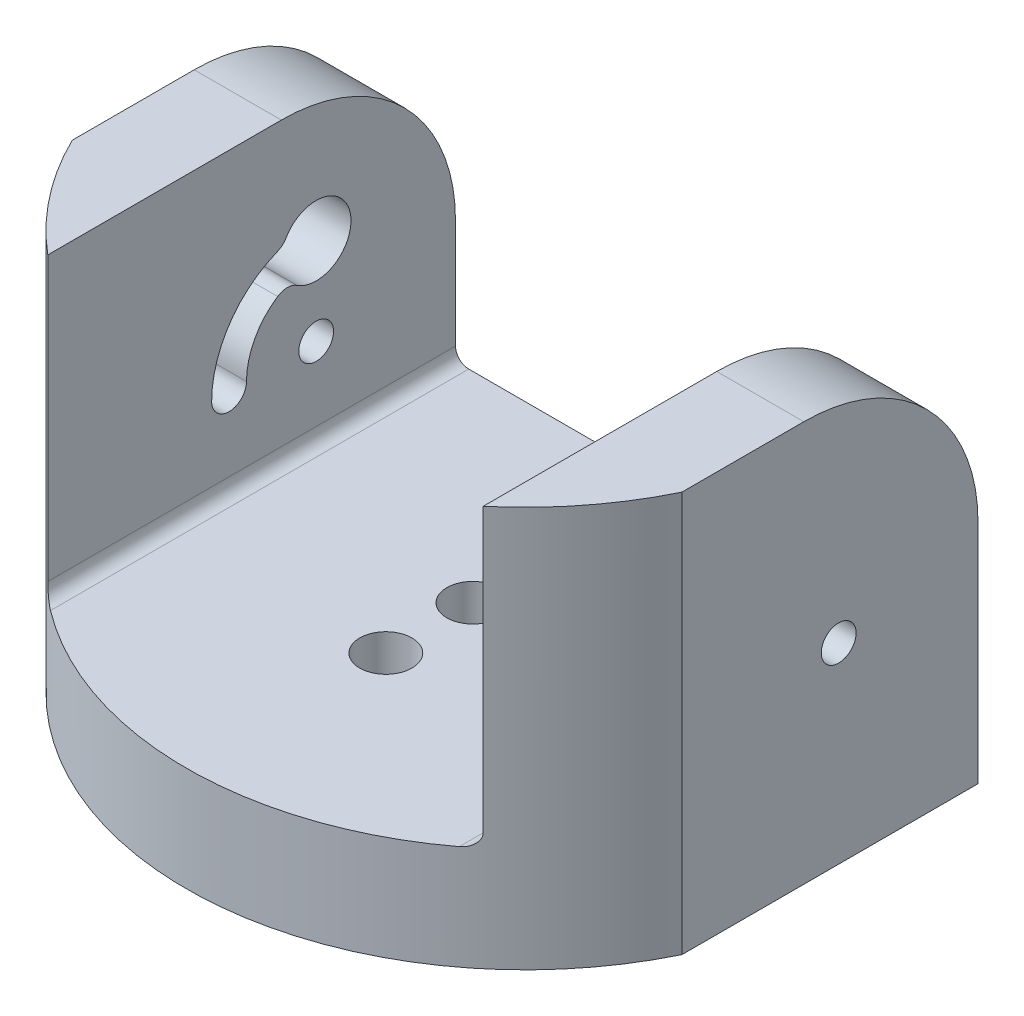
ISO-10303-21;
HEADER;
FILE_DESCRIPTION(('STEP AP214'),'2;1');
FILE_NAME('part.step','',(''),(''),'','','');
FILE_SCHEMA(('AUTOMOTIVE_DESIGN { 1 0 10303 214 1 1 1 1 }'));
ENDSEC;
DATA;
#1=APPLICATION_CONTEXT('core data for automotive mechanical design processes');
#2=APPLICATION_PROTOCOL_DEFINITION('international standard','automotive_design',2000,#1);
#3=PRODUCT_CONTEXT('',#1,'mechanical');
#4=PRODUCT('Part','Part','',(#3));
#5=PRODUCT_RELATED_PRODUCT_CATEGORY('part','',(#4));
#6=PRODUCT_DEFINITION_FORMATION('','',#4);
#7=PRODUCT_DEFINITION_CONTEXT('part definition',#1,'design');
#8=PRODUCT_DEFINITION('design','',#6,#7);
#9=PRODUCT_DEFINITION_SHAPE('','',#8);
#10=(LENGTH_UNIT() NAMED_UNIT(*) SI_UNIT(.MILLI.,.METRE.));
#11=(NAMED_UNIT(*) PLANE_ANGLE_UNIT() SI_UNIT($,.RADIAN.));
#12=(NAMED_UNIT(*) SI_UNIT($,.STERADIAN.) SOLID_ANGLE_UNIT());
#13=UNCERTAINTY_MEASURE_WITH_UNIT(LENGTH_MEASURE(1.E-05),#10,'distance_accuracy_value','');
#14=(GEOMETRIC_REPRESENTATION_CONTEXT(3) GLOBAL_UNCERTAINTY_ASSIGNED_CONTEXT((#13)) GLOBAL_UNIT_ASSIGNED_CONTEXT((#10,
#11,#12)) REPRESENTATION_CONTEXT('',''));
#15=CARTESIAN_POINT('',(0.,0.,0.));
#16=DIRECTION('',(0.,0.,1.));
#17=DIRECTION('',(1.,0.,0.));
#18=AXIS2_PLACEMENT_3D('',#15,#16,#17);
#19=CARTESIAN_POINT('',(0.,6.,0.));
#20=DIRECTION('',(0.,-1.,0.));
#21=DIRECTION('',(0.,0.,-1.));
#22=AXIS2_PLACEMENT_3D('',#19,#20,#21);
#23=PLANE('',#22);
#24=CARTESIAN_POINT('',(0.,6.,-11.));
#25=DIRECTION('',(0.,1.,0.));
#26=DIRECTION('',(0.,0.,1.));
#27=AXIS2_PLACEMENT_3D('',#24,#25,#26);
#28=CIRCLE('',#27,1.5);
#29=CARTESIAN_POINT('',(0.,6.,-9.5));
#30=VERTEX_POINT('',#29);
#31=EDGE_CURVE('E724',#30,#30,#28,.T.);
#32=ORIENTED_EDGE('',*,*,#31,.F.);
#33=EDGE_LOOP('',(#32));
#34=FACE_BOUND('',#33,.T.);
#35=CARTESIAN_POINT('',(0.,6.,-6.));
#36=DIRECTION('',(0.,1.,0.));
#37=DIRECTION('',(0.,0.,1.));
#38=AXIS2_PLACEMENT_3D('',#35,#36,#37);
#39=CIRCLE('',#38,1.5);
#40=CARTESIAN_POINT('',(0.,6.,-4.5));
#41=VERTEX_POINT('',#40);
#42=EDGE_CURVE('E734',#41,#41,#39,.T.);
#43=ORIENTED_EDGE('',*,*,#42,.F.);
#44=EDGE_LOOP('',(#43));
#45=FACE_BOUND('',#44,.T.);
#46=DIRECTION('',(0.,0.,1.));
#47=VECTOR('',#46,1.);
#48=CARTESIAN_POINT('',(-11.738,6.,0.));
#49=LINE('',#48,#47);
#50=CARTESIAN_POINT('',(-11.738,6.,-22.5));
#51=VERTEX_POINT('',#50);
#52=CARTESIAN_POINT('',(-11.738,6.,1.51513312865861));
#53=VERTEX_POINT('',#52);
#54=EDGE_CURVE('E227',#51,#53,#49,.T.);
#55=ORIENTED_EDGE('',*,*,#54,.T.);
#56=CARTESIAN_POINT('',(0.,6.,-14.));
#57=DIRECTION('',(0.,-1.,0.));
#58=DIRECTION('',(0.,0.,-1.));
#59=AXIS2_PLACEMENT_3D('',#56,#57,#58);
#60=CIRCLE('',#59,19.4550764583437);
#61=CARTESIAN_POINT('',(11.738,6.,1.51513312865861));
#62=VERTEX_POINT('',#61);
#63=EDGE_CURVE('E64',#53,#62,#60,.F.);
#64=ORIENTED_EDGE('',*,*,#63,.T.);
#65=DIRECTION('',(0.,0.,1.));
#66=VECTOR('',#65,1.);
#67=CARTESIAN_POINT('',(11.738,6.,0.));
#68=LINE('',#67,#66);
#69=CARTESIAN_POINT('',(11.738,6.,-22.5));
#70=VERTEX_POINT('',#69);
#71=EDGE_CURVE('E231',#62,#70,#68,.F.);
#72=ORIENTED_EDGE('',*,*,#71,.T.);
#73=DIRECTION('',(-1.,0.,0.));
#74=VECTOR('',#73,1.);
#75=CARTESIAN_POINT('',(-17.5,6.,-22.5));
#76=LINE('',#75,#74);
#77=EDGE_CURVE('E200',#70,#51,#76,.T.);
#78=ORIENTED_EDGE('',*,*,#77,.T.);
#79=EDGE_LOOP('',(#55,#64,#72,#78));
#80=FACE_BOUND('',#79,.T.);
#81=ADVANCED_FACE('F42',(#34,#45,#80),#23,.F.);
#82=CARTESIAN_POINT('',(0.,0.,0.));
#83=DIRECTION('',(0.,-1.,0.));
#84=DIRECTION('',(0.,0.,-1.));
#85=AXIS2_PLACEMENT_3D('',#82,#83,#84);
#86=PLANE('',#85);
#87=CARTESIAN_POINT('',(0.,0.,-11.));
#88=DIRECTION('',(0.,-1.,0.));
#89=DIRECTION('',(0.,0.,-1.));
#90=AXIS2_PLACEMENT_3D('',#87,#88,#89);
#91=CIRCLE('',#90,1.5);
#92=CARTESIAN_POINT('',(0.,0.,-12.5));
#93=VERTEX_POINT('',#92);
#94=EDGE_CURVE('E193',#93,#93,#91,.F.);
#95=ORIENTED_EDGE('',*,*,#94,.T.);
#96=EDGE_LOOP('',(#95));
#97=FACE_BOUND('',#96,.T.);
#98=CARTESIAN_POINT('',(0.,0.,-6.));
#99=DIRECTION('',(0.,-1.,0.));
#100=DIRECTION('',(0.,0.,-1.));
#101=AXIS2_PLACEMENT_3D('',#98,#99,#100);
#102=CIRCLE('',#101,1.5);
#103=CARTESIAN_POINT('',(0.,0.,-7.5));
#104=VERTEX_POINT('',#103);
#105=EDGE_CURVE('E731',#104,#104,#102,.F.);
#106=ORIENTED_EDGE('',*,*,#105,.T.);
#107=EDGE_LOOP('',(#106));
#108=FACE_BOUND('',#107,.T.);
#109=CARTESIAN_POINT('',(0.,0.,-14.));
#110=DIRECTION('',(0.,1.,0.));
#111=DIRECTION('',(0.,0.,-1.));
#112=AXIS2_PLACEMENT_3D('',#109,#110,#111);
#113=CIRCLE('',#112,19.4550764583437);
#114=CARTESIAN_POINT('',(-17.5,0.,-5.49999999999999));
#115=VERTEX_POINT('',#114);
#116=CARTESIAN_POINT('',(17.5,0.,-5.50000000000001));
#117=VERTEX_POINT('',#116);
#118=EDGE_CURVE('E175',#115,#117,#113,.T.);
#119=ORIENTED_EDGE('',*,*,#118,.F.);
#120=DIRECTION('',(0.,0.,1.));
#121=VECTOR('',#120,1.);
#122=CARTESIAN_POINT('',(-17.5,0.,22.5));
#123=LINE('',#122,#121);
#124=CARTESIAN_POINT('',(-17.5,0.,-22.5));
#125=VERTEX_POINT('',#124);
#126=EDGE_CURVE('E190',#125,#115,#123,.T.);
#127=ORIENTED_EDGE('',*,*,#126,.F.);
#128=DIRECTION('',(-1.,0.,0.));
#129=VECTOR('',#128,1.);
#130=CARTESIAN_POINT('',(-17.5,0.,-22.5));
#131=LINE('',#130,#129);
#132=CARTESIAN_POINT('',(17.5,0.,-22.5));
#133=VERTEX_POINT('',#132);
#134=EDGE_CURVE('E201',#133,#125,#131,.T.);
#135=ORIENTED_EDGE('',*,*,#134,.F.);
#136=DIRECTION('',(0.,0.,-1.));
#137=VECTOR('',#136,1.);
#138=CARTESIAN_POINT('',(17.5,0.,22.5));
#139=LINE('',#138,#137);
#140=EDGE_CURVE('E191',#117,#133,#139,.T.);
#141=ORIENTED_EDGE('',*,*,#140,.F.);
#142=EDGE_LOOP('',(#119,#127,#135,#141));
#143=FACE_BOUND('',#142,.T.);
#144=ADVANCED_FACE('F188',(#97,#108,#143),#86,.T.);
#145=CARTESIAN_POINT('',(-12.5,23.,-22.5));
#146=DIRECTION('',(0.,1.,0.));
#147=DIRECTION('',(0.,0.,1.));
#148=AXIS2_PLACEMENT_3D('',#145,#146,#147);
#149=PLANE('',#148);
#150=CARTESIAN_POINT('',(0.,23.,-14.));
#151=DIRECTION('',(0.,1.,0.));
#152=DIRECTION('',(0.,0.,1.));
#153=AXIS2_PLACEMENT_3D('',#150,#151,#152);
#154=CIRCLE('',#153,19.4550764583437);
#155=CARTESIAN_POINT('',(-17.5,23.,-5.49999999999999));
#156=VERTEX_POINT('',#155);
#157=CARTESIAN_POINT('',(-12.5,23.,0.90805151587557));
#158=VERTEX_POINT('',#157);
#159=EDGE_CURVE('E178',#156,#158,#154,.T.);
#160=ORIENTED_EDGE('',*,*,#159,.T.);
#161=DIRECTION('',(0.,0.,-1.));
#162=VECTOR('',#161,1.);
#163=CARTESIAN_POINT('',(-12.5,23.,-22.5));
#164=LINE('',#163,#162);
#165=CARTESIAN_POINT('',(-12.5,23.,-12.5));
#166=VERTEX_POINT('',#165);
#167=EDGE_CURVE('E349',#158,#166,#164,.T.);
#168=ORIENTED_EDGE('',*,*,#167,.T.);
#169=DIRECTION('',(-1.,0.,0.));
#170=VECTOR('',#169,1.);
#171=CARTESIAN_POINT('',(-17.5,23.,-12.5));
#172=LINE('',#171,#170);
#173=CARTESIAN_POINT('',(-17.5,23.,-12.5));
#174=VERTEX_POINT('',#173);
#175=EDGE_CURVE('E247',#166,#174,#172,.T.);
#176=ORIENTED_EDGE('',*,*,#175,.T.);
#177=DIRECTION('',(0.,0.,-1.));
#178=VECTOR('',#177,1.);
#179=CARTESIAN_POINT('',(-17.5,23.,-22.5));
#180=LINE('',#179,#178);
#181=EDGE_CURVE('E346',#156,#174,#180,.T.);
#182=ORIENTED_EDGE('',*,*,#181,.F.);
#183=EDGE_LOOP('',(#160,#168,#176,#182));
#184=FACE_BOUND('',#183,.T.);
#185=ADVANCED_FACE('F439',(#184),#149,.T.);
#186=CARTESIAN_POINT('',(12.5,23.,-22.5));
#187=DIRECTION('',(0.,-1.,0.));
#188=DIRECTION('',(0.,0.,-1.));
#189=AXIS2_PLACEMENT_3D('',#186,#187,#188);
#190=PLANE('',#189);
#191=DIRECTION('',(0.,0.,-1.));
#192=VECTOR('',#191,1.);
#193=CARTESIAN_POINT('',(12.5,23.,-22.5));
#194=LINE('',#193,#192);
#195=CARTESIAN_POINT('',(12.5,23.,0.90805151587557));
#196=VERTEX_POINT('',#195);
#197=CARTESIAN_POINT('',(12.5,23.,-12.5));
#198=VERTEX_POINT('',#197);
#199=EDGE_CURVE('E343',#196,#198,#194,.T.);
#200=ORIENTED_EDGE('',*,*,#199,.F.);
#201=CARTESIAN_POINT('',(17.5,23.,-5.50000000000001));
#202=VERTEX_POINT('',#201);
#203=EDGE_CURVE('E183',#196,#202,#154,.T.);
#204=ORIENTED_EDGE('',*,*,#203,.T.);
#205=DIRECTION('',(0.,0.,-1.));
#206=VECTOR('',#205,1.);
#207=CARTESIAN_POINT('',(17.5,23.,-22.5));
#208=LINE('',#207,#206);
#209=CARTESIAN_POINT('',(17.5,23.,-12.5));
#210=VERTEX_POINT('',#209);
#211=EDGE_CURVE('E339',#202,#210,#208,.T.);
#212=ORIENTED_EDGE('',*,*,#211,.T.);
#213=DIRECTION('',(1.,0.,0.));
#214=VECTOR('',#213,1.);
#215=CARTESIAN_POINT('',(12.5,23.,-12.5));
#216=LINE('',#215,#214);
#217=EDGE_CURVE('E255',#210,#198,#216,.F.);
#218=ORIENTED_EDGE('',*,*,#217,.T.);
#219=EDGE_LOOP('',(#200,#204,#212,#218));
#220=FACE_BOUND('',#219,.T.);
#221=ADVANCED_FACE('F375',(#220),#190,.F.);
#222=CARTESIAN_POINT('',(17.5,6.,22.5));
#223=DIRECTION('',(-1.,0.,0.));
#224=DIRECTION('',(0.,0.,1.));
#225=AXIS2_PLACEMENT_3D('',#222,#223,#224);
#226=PLANE('',#225);
#227=CARTESIAN_POINT('',(17.5,11.,-14.5));
#228=DIRECTION('',(-1.,0.,0.));
#229=DIRECTION('',(0.,0.,1.));
#230=AXIS2_PLACEMENT_3D('',#227,#228,#229);
#231=CIRCLE('',#230,1.);
#232=CARTESIAN_POINT('',(17.5,11.,-13.5));
#233=VERTEX_POINT('',#232);
#234=EDGE_CURVE('E223',#233,#233,#231,.T.);
#235=ORIENTED_EDGE('',*,*,#234,.T.);
#236=EDGE_LOOP('',(#235));
#237=FACE_BOUND('',#236,.T.);
#238=ORIENTED_EDGE('',*,*,#211,.F.);
#239=DIRECTION('',(0.,-1.,0.));
#240=VECTOR('',#239,1.);
#241=CARTESIAN_POINT('',(17.5,67.8218696620299,-5.50000000000001));
#242=LINE('',#241,#240);
#243=EDGE_CURVE('E363',#202,#117,#242,.T.);
#244=ORIENTED_EDGE('',*,*,#243,.T.);
#245=ORIENTED_EDGE('',*,*,#140,.T.);
#246=DIRECTION('',(0.,-1.,0.));
#247=VECTOR('',#246,1.);
#248=CARTESIAN_POINT('',(17.5,6.,-22.5));
#249=LINE('',#248,#247);
#250=CARTESIAN_POINT('',(17.5,13.,-22.5));
#251=VERTEX_POINT('',#250);
#252=EDGE_CURVE('E213',#251,#133,#249,.T.);
#253=ORIENTED_EDGE('',*,*,#252,.F.);
#254=CARTESIAN_POINT('',(17.5,13.,-12.5));
#255=DIRECTION('',(-1.,0.,0.));
#256=DIRECTION('',(0.,0.,1.));
#257=AXIS2_PLACEMENT_3D('',#254,#255,#256);
#258=CIRCLE('',#257,10.);
#259=EDGE_CURVE('E259',#251,#210,#258,.F.);
#260=ORIENTED_EDGE('',*,*,#259,.T.);
#261=EDGE_LOOP('',(#238,#244,#245,#253,#260));
#262=FACE_BOUND('',#261,.T.);
#263=ADVANCED_FACE('F362',(#237,#262),#226,.F.);
#264=CARTESIAN_POINT('',(-17.5,6.,-22.5));
#265=DIRECTION('',(0.,0.,1.));
#266=DIRECTION('',(1.,0.,0.));
#267=AXIS2_PLACEMENT_3D('',#264,#265,#266);
#268=PLANE('',#267);
#269=DIRECTION('',(0.,-1.,0.));
#270=VECTOR('',#269,1.);
#271=CARTESIAN_POINT('',(12.5,6.,-22.5));
#272=LINE('',#271,#270);
#273=CARTESIAN_POINT('',(12.5,13.,-22.5));
#274=VERTEX_POINT('',#273);
#275=CARTESIAN_POINT('',(12.5,6.762,-22.5));
#276=VERTEX_POINT('',#275);
#277=EDGE_CURVE('E340',#274,#276,#272,.T.);
#278=ORIENTED_EDGE('',*,*,#277,.F.);
#279=DIRECTION('',(1.,0.,0.));
#280=VECTOR('',#279,1.);
#281=CARTESIAN_POINT('',(-17.5,13.,-22.5));
#282=LINE('',#281,#280);
#283=EDGE_CURVE('E269',#274,#251,#282,.T.);
#284=ORIENTED_EDGE('',*,*,#283,.T.);
#285=ORIENTED_EDGE('',*,*,#252,.T.);
#286=ORIENTED_EDGE('',*,*,#134,.T.);
#287=DIRECTION('',(0.,-1.,0.));
#288=VECTOR('',#287,1.);
#289=CARTESIAN_POINT('',(-17.5,6.,-22.5));
#290=LINE('',#289,#288);
#291=CARTESIAN_POINT('',(-17.5,13.,-22.5));
#292=VERTEX_POINT('',#291);
#293=EDGE_CURVE('E197',#292,#125,#290,.T.);
#294=ORIENTED_EDGE('',*,*,#293,.F.);
#295=DIRECTION('',(-1.,0.,0.));
#296=VECTOR('',#295,1.);
#297=CARTESIAN_POINT('',(-12.5,13.,-22.5));
#298=LINE('',#297,#296);
#299=CARTESIAN_POINT('',(-12.5,13.,-22.5));
#300=VERTEX_POINT('',#299);
#301=EDGE_CURVE('E266',#292,#300,#298,.F.);
#302=ORIENTED_EDGE('',*,*,#301,.T.);
#303=DIRECTION('',(0.,-1.,0.));
#304=VECTOR('',#303,1.);
#305=CARTESIAN_POINT('',(-12.5,6.,-22.5));
#306=LINE('',#305,#304);
#307=CARTESIAN_POINT('',(-12.5,6.762,-22.5));
#308=VERTEX_POINT('',#307);
#309=EDGE_CURVE('E352',#300,#308,#306,.T.);
#310=ORIENTED_EDGE('',*,*,#309,.T.);
#311=CARTESIAN_POINT('',(-11.738,6.762,-22.5));
#312=DIRECTION('',(0.,0.,1.));
#313=DIRECTION('',(1.,0.,0.));
#314=AXIS2_PLACEMENT_3D('',#311,#312,#313);
#315=CIRCLE('',#314,0.762);
#316=EDGE_CURVE('E241',#308,#51,#315,.T.);
#317=ORIENTED_EDGE('',*,*,#316,.T.);
#318=ORIENTED_EDGE('',*,*,#77,.F.);
#319=CARTESIAN_POINT('',(11.738,6.762,-22.5));
#320=DIRECTION('',(0.,0.,1.));
#321=DIRECTION('',(1.,0.,0.));
#322=AXIS2_PLACEMENT_3D('',#319,#320,#321);
#323=CIRCLE('',#322,0.762);
#324=EDGE_CURVE('E237',#70,#276,#323,.T.);
#325=ORIENTED_EDGE('',*,*,#324,.T.);
#326=EDGE_LOOP('',(#278,#284,#285,#286,#294,#302,#310,#317,#318,#325));
#327=FACE_BOUND('',#326,.T.);
#328=ADVANCED_FACE('F366',(#327),#268,.F.);
#329=CARTESIAN_POINT('',(-17.5,6.,22.5));
#330=DIRECTION('',(1.,0.,0.));
#331=DIRECTION('',(0.,0.,-1.));
#332=AXIS2_PLACEMENT_3D('',#329,#330,#331);
#333=PLANE('',#332);
#334=CARTESIAN_POINT('',(-17.5,11.,-14.5));
#335=DIRECTION('',(1.,0.,0.));
#336=DIRECTION('',(0.,0.,-1.));
#337=AXIS2_PLACEMENT_3D('',#334,#335,#336);
#338=CIRCLE('',#337,1.);
#339=CARTESIAN_POINT('',(-17.5,11.,-15.5));
#340=VERTEX_POINT('',#339);
#341=EDGE_CURVE('E314',#340,#340,#338,.F.);
#342=ORIENTED_EDGE('',*,*,#341,.F.);
#343=EDGE_LOOP('',(#342));
#344=FACE_BOUND('',#343,.T.);
#345=CARTESIAN_POINT('',(-17.5,11.,-14.5));
#346=DIRECTION('',(1.,0.,0.));
#347=DIRECTION('',(0.,0.,-1.));
#348=AXIS2_PLACEMENT_3D('',#345,#346,#347);
#349=CIRCLE('',#348,4.);
#350=CARTESIAN_POINT('',(-17.5,14.3333333333333,-12.2889168064297));
#351=VERTEX_POINT('',#350);
#352=CARTESIAN_POINT('',(-17.5,11.,-10.5));
#353=VERTEX_POINT('',#352);
#354=EDGE_CURVE('E324',#351,#353,#349,.T.);
#355=ORIENTED_EDGE('',*,*,#354,.F.);
#356=CARTESIAN_POINT('',(-17.5,13.5,-12.8416876048223));
#357=DIRECTION('',(1.,0.,0.));
#358=DIRECTION('',(0.,0.,-1.));
#359=AXIS2_PLACEMENT_3D('',#356,#357,#358);
#360=CIRCLE('',#359,1.);
#361=CARTESIAN_POINT('',(-17.5,14.3333333333333,-13.3944584032149));
#362=VERTEX_POINT('',#361);
#363=EDGE_CURVE('E280',#351,#362,#360,.F.);
#364=ORIENTED_EDGE('',*,*,#363,.T.);
#365=CARTESIAN_POINT('',(-17.5,16.,-14.5));
#366=DIRECTION('',(-1.,0.,0.));
#367=DIRECTION('',(0.,0.,1.));
#368=AXIS2_PLACEMENT_3D('',#365,#366,#367);
#369=CIRCLE('',#368,2.);
#370=CARTESIAN_POINT('',(-17.5,17.,-12.7679491924311));
#371=VERTEX_POINT('',#370);
#372=EDGE_CURVE('E468',#371,#362,#369,.T.);
#373=ORIENTED_EDGE('',*,*,#372,.F.);
#374=CARTESIAN_POINT('',(-17.5,17.5,-11.9019237886467));
#375=DIRECTION('',(1.,0.,0.));
#376=DIRECTION('',(0.,0.,-1.));
#377=AXIS2_PLACEMENT_3D('',#374,#375,#376);
#378=CIRCLE('',#377,1.);
#379=CARTESIAN_POINT('',(-17.5,16.5714285714286,-12.2730775331257));
#380=VERTEX_POINT('',#379);
#381=EDGE_CURVE('E277',#371,#380,#378,.F.);
#382=ORIENTED_EDGE('',*,*,#381,.T.);
#383=CARTESIAN_POINT('',(-17.5,11.,-14.5));
#384=DIRECTION('',(1.,0.,0.));
#385=DIRECTION('',(0.,0.,-1.));
#386=AXIS2_PLACEMENT_3D('',#383,#384,#385);
#387=CIRCLE('',#386,5.99999999999999);
#388=CARTESIAN_POINT('',(-17.5,11.,-8.50000000000001));
#389=VERTEX_POINT('',#388);
#390=EDGE_CURVE('E302',#389,#380,#387,.F.);
#391=ORIENTED_EDGE('',*,*,#390,.F.);
#392=CARTESIAN_POINT('',(-17.5,11.,-9.5));
#393=DIRECTION('',(1.,0.,0.));
#394=DIRECTION('',(0.,0.,-1.));
#395=AXIS2_PLACEMENT_3D('',#392,#393,#394);
#396=CIRCLE('',#395,0.999999999999996);
#397=EDGE_CURVE('E334',#353,#389,#396,.F.);
#398=ORIENTED_EDGE('',*,*,#397,.F.);
#399=EDGE_LOOP('',(#355,#364,#373,#382,#391,#398));
#400=FACE_BOUND('',#399,.T.);
#401=ORIENTED_EDGE('',*,*,#126,.T.);
#402=DIRECTION('',(0.,-1.,0.));
#403=VECTOR('',#402,1.);
#404=CARTESIAN_POINT('',(-17.5,67.8218696620299,-5.49999999999999));
#405=LINE('',#404,#403);
#406=EDGE_CURVE('E172',#156,#115,#405,.T.);
#407=ORIENTED_EDGE('',*,*,#406,.F.);
#408=ORIENTED_EDGE('',*,*,#181,.T.);
#409=CARTESIAN_POINT('',(-17.5,13.,-12.5));
#410=DIRECTION('',(1.,0.,0.));
#411=DIRECTION('',(0.,0.,-1.));
#412=AXIS2_PLACEMENT_3D('',#409,#410,#411);
#413=CIRCLE('',#412,10.);
#414=EDGE_CURVE('E244',#174,#292,#413,.F.);
#415=ORIENTED_EDGE('',*,*,#414,.T.);
#416=ORIENTED_EDGE('',*,*,#293,.T.);
#417=EDGE_LOOP('',(#401,#407,#408,#415,#416));
#418=FACE_BOUND('',#417,.T.);
#419=ADVANCED_FACE('F195',(#344,#400,#418),#333,.F.);
#420=CARTESIAN_POINT('',(-12.5,0.,0.));
#421=DIRECTION('',(1.,0.,0.));
#422=DIRECTION('',(0.,0.,-1.));
#423=AXIS2_PLACEMENT_3D('',#420,#421,#422);
#424=PLANE('',#423);
#425=DIRECTION('',(0.,-1.,0.));
#426=VECTOR('',#425,1.);
#427=CARTESIAN_POINT('',(-12.5,67.8218696620299,0.90805151587557));
#428=LINE('',#427,#426);
#429=CARTESIAN_POINT('',(-12.5,6.762,0.90805151587557));
#430=VERTEX_POINT('',#429);
#431=EDGE_CURVE('E385',#430,#158,#428,.F.);
#432=ORIENTED_EDGE('',*,*,#431,.F.);
#433=DIRECTION('',(0.,0.,1.));
#434=VECTOR('',#433,1.);
#435=CARTESIAN_POINT('',(-12.5,6.762,0.));
#436=LINE('',#435,#434);
#437=EDGE_CURVE('E234',#430,#308,#436,.F.);
#438=ORIENTED_EDGE('',*,*,#437,.T.);
#439=ORIENTED_EDGE('',*,*,#309,.F.);
#440=CARTESIAN_POINT('',(-12.5,13.,-12.5));
#441=DIRECTION('',(1.,0.,0.));
#442=DIRECTION('',(0.,0.,-1.));
#443=AXIS2_PLACEMENT_3D('',#440,#441,#442);
#444=CIRCLE('',#443,10.);
#445=EDGE_CURVE('E251',#300,#166,#444,.T.);
#446=ORIENTED_EDGE('',*,*,#445,.T.);
#447=ORIENTED_EDGE('',*,*,#167,.F.);
#448=EDGE_LOOP('',(#432,#438,#439,#446,#447));
#449=FACE_BOUND('',#448,.T.);
#450=CARTESIAN_POINT('',(-12.5,16.,-14.5));
#451=DIRECTION('',(1.,0.,0.));
#452=DIRECTION('',(0.,0.,-1.));
#453=AXIS2_PLACEMENT_3D('',#450,#451,#452);
#454=CIRCLE('',#453,2.);
#455=CARTESIAN_POINT('',(-12.5,17.,-12.7679491924311));
#456=VERTEX_POINT('',#455);
#457=CARTESIAN_POINT('',(-12.5,14.3333333333333,-13.3944584032149));
#458=VERTEX_POINT('',#457);
#459=EDGE_CURVE('E464',#456,#458,#454,.F.);
#460=ORIENTED_EDGE('',*,*,#459,.T.);
#461=CARTESIAN_POINT('',(-12.5,13.5,-12.8416876048223));
#462=DIRECTION('',(1.,0.,0.));
#463=DIRECTION('',(0.,0.,-1.));
#464=AXIS2_PLACEMENT_3D('',#461,#462,#463);
#465=CIRCLE('',#464,1.);
#466=CARTESIAN_POINT('',(-12.5,14.3333333333333,-12.2889168064297));
#467=VERTEX_POINT('',#466);
#468=EDGE_CURVE('E291',#458,#467,#465,.T.);
#469=ORIENTED_EDGE('',*,*,#468,.T.);
#470=CARTESIAN_POINT('',(-12.5,11.,-14.5));
#471=DIRECTION('',(-1.,0.,0.));
#472=DIRECTION('',(0.,0.,-1.));
#473=AXIS2_PLACEMENT_3D('',#470,#471,#472);
#474=CIRCLE('',#473,4.);
#475=CARTESIAN_POINT('',(-12.5,11.,-10.5));
#476=VERTEX_POINT('',#475);
#477=EDGE_CURVE('E319',#476,#467,#474,.T.);
#478=ORIENTED_EDGE('',*,*,#477,.F.);
#479=CARTESIAN_POINT('',(-12.5,11.,-9.5));
#480=DIRECTION('',(1.,0.,0.));
#481=DIRECTION('',(0.,0.,-1.));
#482=AXIS2_PLACEMENT_3D('',#479,#480,#481);
#483=CIRCLE('',#482,0.999999999999996);
#484=CARTESIAN_POINT('',(-12.5,11.,-8.50000000000001));
#485=VERTEX_POINT('',#484);
#486=EDGE_CURVE('E312',#485,#476,#483,.T.);
#487=ORIENTED_EDGE('',*,*,#486,.F.);
#488=CARTESIAN_POINT('',(-12.5,11.,-14.5));
#489=DIRECTION('',(1.,0.,0.));
#490=DIRECTION('',(0.,0.,-1.));
#491=AXIS2_PLACEMENT_3D('',#488,#489,#490);
#492=CIRCLE('',#491,5.99999999999999);
#493=CARTESIAN_POINT('',(-12.5,16.5714285714286,-12.2730775331257));
#494=VERTEX_POINT('',#493);
#495=EDGE_CURVE('E299',#494,#485,#492,.T.);
#496=ORIENTED_EDGE('',*,*,#495,.F.);
#497=CARTESIAN_POINT('',(-12.5,17.5,-11.9019237886467));
#498=DIRECTION('',(1.,0.,0.));
#499=DIRECTION('',(0.,0.,-1.));
#500=AXIS2_PLACEMENT_3D('',#497,#498,#499);
#501=CIRCLE('',#500,1.);
#502=EDGE_CURVE('E71',#494,#456,#501,.T.);
#503=ORIENTED_EDGE('',*,*,#502,.T.);
#504=EDGE_LOOP('',(#460,#469,#478,#487,#496,#503));
#505=FACE_BOUND('',#504,.T.);
#506=CARTESIAN_POINT('',(-12.5,11.,-14.5));
#507=DIRECTION('',(1.,0.,0.));
#508=DIRECTION('',(0.,0.,-1.));
#509=AXIS2_PLACEMENT_3D('',#506,#507,#508);
#510=CIRCLE('',#509,1.);
#511=CARTESIAN_POINT('',(-12.5,11.,-15.5));
#512=VERTEX_POINT('',#511);
#513=EDGE_CURVE('E222',#512,#512,#510,.T.);
#514=ORIENTED_EDGE('',*,*,#513,.F.);
#515=EDGE_LOOP('',(#514));
#516=FACE_BOUND('',#515,.T.);
#517=ADVANCED_FACE('F307',(#449,#505,#516),#424,.T.);
#518=CARTESIAN_POINT('',(12.5,0.,0.));
#519=DIRECTION('',(-1.,0.,0.));
#520=DIRECTION('',(0.,0.,-1.));
#521=AXIS2_PLACEMENT_3D('',#518,#519,#520);
#522=PLANE('',#521);
#523=DIRECTION('',(0.,-1.,0.));
#524=VECTOR('',#523,1.);
#525=CARTESIAN_POINT('',(12.5,67.8218696620299,0.90805151587557));
#526=LINE('',#525,#524);
#527=CARTESIAN_POINT('',(12.5,6.762,0.90805151587557));
#528=VERTEX_POINT('',#527);
#529=EDGE_CURVE('E399',#196,#528,#526,.T.);
#530=ORIENTED_EDGE('',*,*,#529,.F.);
#531=ORIENTED_EDGE('',*,*,#199,.T.);
#532=CARTESIAN_POINT('',(12.5,13.,-12.5));
#533=DIRECTION('',(-1.,0.,0.));
#534=DIRECTION('',(0.,0.,1.));
#535=AXIS2_PLACEMENT_3D('',#532,#533,#534);
#536=CIRCLE('',#535,10.);
#537=EDGE_CURVE('E263',#198,#274,#536,.T.);
#538=ORIENTED_EDGE('',*,*,#537,.T.);
#539=ORIENTED_EDGE('',*,*,#277,.T.);
#540=DIRECTION('',(0.,0.,1.));
#541=VECTOR('',#540,1.);
#542=CARTESIAN_POINT('',(12.5,6.762,0.));
#543=LINE('',#542,#541);
#544=EDGE_CURVE('E217',#276,#528,#543,.T.);
#545=ORIENTED_EDGE('',*,*,#544,.T.);
#546=EDGE_LOOP('',(#530,#531,#538,#539,#545));
#547=FACE_BOUND('',#546,.T.);
#548=CARTESIAN_POINT('',(12.5,11.,-14.5));
#549=DIRECTION('',(-1.,0.,0.));
#550=DIRECTION('',(0.,0.,1.));
#551=AXIS2_PLACEMENT_3D('',#548,#549,#550);
#552=CIRCLE('',#551,1.);
#553=CARTESIAN_POINT('',(12.5,11.,-13.5));
#554=VERTEX_POINT('',#553);
#555=EDGE_CURVE('E218',#554,#554,#552,.F.);
#556=ORIENTED_EDGE('',*,*,#555,.T.);
#557=EDGE_LOOP('',(#556));
#558=FACE_BOUND('',#557,.T.);
#559=ADVANCED_FACE('F427',(#547,#558),#522,.T.);
#560=CARTESIAN_POINT('',(-27.3994949366116,11.,-14.5));
#561=DIRECTION('',(1.,0.,0.));
#562=DIRECTION('',(0.,0.,-1.));
#563=AXIS2_PLACEMENT_3D('',#560,#561,#562);
#564=CYLINDRICAL_SURFACE('',#563,4.);
#565=ORIENTED_EDGE('',*,*,#477,.T.);
#566=DIRECTION('',(1.,0.,0.));
#567=VECTOR('',#566,1.);
#568=CARTESIAN_POINT('',(-27.3994949366116,14.3333333333333,-12.2889168064297));
#569=LINE('',#568,#567);
#570=EDGE_CURVE('E273',#467,#351,#569,.F.);
#571=ORIENTED_EDGE('',*,*,#570,.T.);
#572=ORIENTED_EDGE('',*,*,#354,.T.);
#573=DIRECTION('',(1.,0.,0.));
#574=VECTOR('',#573,1.);
#575=CARTESIAN_POINT('',(-27.3994949366116,11.,-10.5));
#576=LINE('',#575,#574);
#577=EDGE_CURVE('E331',#353,#476,#576,.T.);
#578=ORIENTED_EDGE('',*,*,#577,.T.);
#579=EDGE_LOOP('',(#565,#571,#572,#578));
#580=FACE_BOUND('',#579,.T.);
#581=ADVANCED_FACE('F423',(#580),#564,.T.);
#582=CARTESIAN_POINT('',(-27.3994949366116,11.,-9.5));
#583=DIRECTION('',(1.,0.,0.));
#584=DIRECTION('',(0.,0.,-1.));
#585=AXIS2_PLACEMENT_3D('',#582,#583,#584);
#586=CYLINDRICAL_SURFACE('',#585,0.999999999999996);
#587=ORIENTED_EDGE('',*,*,#397,.T.);
#588=DIRECTION('',(1.,0.,0.));
#589=VECTOR('',#588,1.);
#590=CARTESIAN_POINT('',(-27.3994949366116,11.,-8.50000000000001));
#591=LINE('',#590,#589);
#592=EDGE_CURVE('E330',#389,#485,#591,.T.);
#593=ORIENTED_EDGE('',*,*,#592,.T.);
#594=ORIENTED_EDGE('',*,*,#486,.T.);
#595=ORIENTED_EDGE('',*,*,#577,.F.);
#596=EDGE_LOOP('',(#587,#593,#594,#595));
#597=FACE_BOUND('',#596,.T.);
#598=ADVANCED_FACE('F426',(#597),#586,.F.);
#599=CARTESIAN_POINT('',(-27.3994949366116,11.,-14.5));
#600=DIRECTION('',(1.,0.,0.));
#601=DIRECTION('',(0.,0.,-1.));
#602=AXIS2_PLACEMENT_3D('',#599,#600,#601);
#603=CYLINDRICAL_SURFACE('',#602,5.99999999999999);
#604=ORIENTED_EDGE('',*,*,#390,.T.);
#605=DIRECTION('',(1.,0.,0.));
#606=VECTOR('',#605,1.);
#607=CARTESIAN_POINT('',(-27.3994949366116,16.5714285714286,-12.2730775331257));
#608=LINE('',#607,#606);
#609=EDGE_CURVE('E57',#380,#494,#608,.T.);
#610=ORIENTED_EDGE('',*,*,#609,.T.);
#611=ORIENTED_EDGE('',*,*,#495,.T.);
#612=ORIENTED_EDGE('',*,*,#592,.F.);
#613=EDGE_LOOP('',(#604,#610,#611,#612));
#614=FACE_BOUND('',#613,.T.);
#615=ADVANCED_FACE('F298',(#614),#603,.F.);
#616=CARTESIAN_POINT('',(-27.3994949366116,11.,-14.5));
#617=DIRECTION('',(1.,0.,0.));
#618=DIRECTION('',(0.,0.,-1.));
#619=AXIS2_PLACEMENT_3D('',#616,#617,#618);
#620=CYLINDRICAL_SURFACE('',#619,1.);
#621=ORIENTED_EDGE('',*,*,#341,.T.);
#622=EDGE_LOOP('',(#621));
#623=FACE_BOUND('',#622,.T.);
#624=ORIENTED_EDGE('',*,*,#513,.T.);
#625=EDGE_LOOP('',(#624));
#626=FACE_BOUND('',#625,.T.);
#627=ADVANCED_FACE('F418',(#623,#626),#620,.F.);
#628=CARTESIAN_POINT('',(20.3284271247462,11.,-14.5));
#629=DIRECTION('',(-1.,0.,0.));
#630=DIRECTION('',(0.,0.,1.));
#631=AXIS2_PLACEMENT_3D('',#628,#629,#630);
#632=CYLINDRICAL_SURFACE('',#631,1.);
#633=ORIENTED_EDGE('',*,*,#555,.F.);
#634=EDGE_LOOP('',(#633));
#635=FACE_BOUND('',#634,.T.);
#636=ORIENTED_EDGE('',*,*,#234,.F.);
#637=EDGE_LOOP('',(#636));
#638=FACE_BOUND('',#637,.T.);
#639=ADVANCED_FACE('F414',(#635,#638),#632,.F.);
#640=CARTESIAN_POINT('',(-6.84314575050762,16.,-14.5));
#641=DIRECTION('',(-1.,0.,0.));
#642=DIRECTION('',(0.,0.,1.));
#643=AXIS2_PLACEMENT_3D('',#640,#641,#642);
#644=CYLINDRICAL_SURFACE('',#643,2.);
#645=ORIENTED_EDGE('',*,*,#372,.T.);
#646=DIRECTION('',(-1.,0.,0.));
#647=VECTOR('',#646,1.);
#648=CARTESIAN_POINT('',(-6.84314575050762,14.3333333333333,-13.3944584032149));
#649=LINE('',#648,#647);
#650=EDGE_CURVE('E286',#362,#458,#649,.F.);
#651=ORIENTED_EDGE('',*,*,#650,.T.);
#652=ORIENTED_EDGE('',*,*,#459,.F.);
#653=DIRECTION('',(-1.,0.,0.));
#654=VECTOR('',#653,1.);
#655=CARTESIAN_POINT('',(-6.84314575050762,17.,-12.7679491924311));
#656=LINE('',#655,#654);
#657=EDGE_CURVE('E283',#456,#371,#656,.T.);
#658=ORIENTED_EDGE('',*,*,#657,.T.);
#659=EDGE_LOOP('',(#645,#651,#652,#658));
#660=FACE_BOUND('',#659,.T.);
#661=ADVANCED_FACE('F410',(#660),#644,.F.);
#662=CARTESIAN_POINT('',(11.738,6.762,0.));
#663=DIRECTION('',(0.,0.,1.));
#664=DIRECTION('',(1.,0.,0.));
#665=AXIS2_PLACEMENT_3D('',#662,#663,#664);
#666=CYLINDRICAL_SURFACE('',#665,0.762);
#667=ORIENTED_EDGE('',*,*,#71,.F.);
#668=CARTESIAN_POINT('',(11.738,6.,1.51513312865861));
#669=CARTESIAN_POINT('',(11.7892525198451,6.00003689604188,1.47637307543122));
#670=CARTESIAN_POINT('',(11.8403335856258,6.00517447666463,1.4373136939503));
#671=CARTESIAN_POINT('',(11.9413384262365,6.02579462864024,1.35931070100306));
#672=CARTESIAN_POINT('',(11.9912441479416,6.04138649142055,1.32037272495573));
#673=CARTESIAN_POINT('',(12.0895919812085,6.08377383043299,1.24289506344281));
#674=CARTESIAN_POINT('',(12.1379255448628,6.11093448420502,1.20441461871146));
#675=CARTESIAN_POINT('',(12.2291143250431,6.17669012889158,1.13116462884198));
#676=CARTESIAN_POINT('',(12.2719946533588,6.21522977400684,1.09637820507077));
#677=CARTESIAN_POINT('',(12.3351064111226,6.28716808800455,1.04480475134848));
#678=CARTESIAN_POINT('',(12.3578060907946,6.31708739479359,1.02615557066332));
#679=CARTESIAN_POINT('',(12.3991601562067,6.38126044822586,0.99204927661498));
#680=CARTESIAN_POINT('',(12.4178186909166,6.41550969161933,0.976588890160493));
#681=CARTESIAN_POINT('',(12.4476314494113,6.48235981834534,0.951815648608157));
#682=CARTESIAN_POINT('',(12.4594928631536,6.51443113203636,0.941927445982815));
#683=CARTESIAN_POINT('',(12.4789154318353,6.58068893116868,0.925710421351886));
#684=CARTESIAN_POINT('',(12.4864844774971,6.61487140645693,0.919375068331056));
#685=CARTESIAN_POINT('',(12.4944285985363,6.66813102851456,0.912721624842102));
#686=CARTESIAN_POINT('',(12.4965126125361,6.68679624250372,0.910975079306831));
#687=CARTESIAN_POINT('',(12.4992997460702,6.72430382443169,0.908638676928832));
#688=CARTESIAN_POINT('',(12.5000026542541,6.74314621904118,0.908048997121061));
#689=CARTESIAN_POINT('',(12.5,6.762,0.908051515875587));
#690=B_SPLINE_CURVE_WITH_KNOTS('',3,(#668,#669,#670,#671,#672,#673,#674,#675,#676,#677,#678,
#679,#680,#681,#682,#683,#684,#685,#686,#687,#688,#689),.UNSPECIFIED.,.F.,.F.,(4,2,2,2,2,2,2,2,
2,2,4),(0.,0.192651234148351,0.387348557371985,0.588709346690803,0.789106441776468,
0.914459362169713,1.03968296844663,1.1460330618377,1.25218701122423,1.30869585586162,
1.36521334736317),.UNSPECIFIED.);
#691=EDGE_CURVE('E390',#62,#528,#690,.T.);
#692=ORIENTED_EDGE('',*,*,#691,.T.);
#693=ORIENTED_EDGE('',*,*,#544,.F.);
#694=ORIENTED_EDGE('',*,*,#324,.F.);
#695=EDGE_LOOP('',(#667,#692,#693,#694));
#696=FACE_BOUND('',#695,.T.);
#697=ADVANCED_FACE('F401',(#696),#666,.F.);
#698=CARTESIAN_POINT('',(-11.738,6.762,0.));
#699=DIRECTION('',(0.,0.,1.));
#700=DIRECTION('',(1.,0.,0.));
#701=AXIS2_PLACEMENT_3D('',#698,#699,#700);
#702=CYLINDRICAL_SURFACE('',#701,0.762);
#703=ORIENTED_EDGE('',*,*,#437,.F.);
#704=CARTESIAN_POINT('',(-12.5,6.762,0.90805151587557));
#705=CARTESIAN_POINT('',(-12.5000019733377,6.74400392676926,0.908049630028333));
#706=CARTESIAN_POINT('',(-12.4993619593796,6.726018290641,0.908586516083282));
#707=CARTESIAN_POINT('',(-12.4968226600167,6.69021008267052,0.910715193976109));
#708=CARTESIAN_POINT('',(-12.4949241668765,6.67238741538456,0.912306322124834));
#709=CARTESIAN_POINT('',(-12.4874171860253,6.61962705251397,0.918594316306186));
#710=CARTESIAN_POINT('',(-12.4799962891083,6.58510375081985,0.924806610916986));
#711=CARTESIAN_POINT('',(-12.4608146260859,6.51829552071866,0.940824989758174));
#712=CARTESIAN_POINT('',(-12.4490631477982,6.48600597631222,0.950623382561438));
#713=CARTESIAN_POINT('',(-12.4218367866154,6.42412906883451,0.973252310686051));
#714=CARTESIAN_POINT('',(-12.4063548569662,6.39454696776805,0.986088583680136));
#715=CARTESIAN_POINT('',(-12.3665900009975,6.32905855989181,1.01893191483186));
#716=CARTESIAN_POINT('',(-12.3410979062216,6.29436802236427,1.03989908535677));
#717=CARTESIAN_POINT('',(-12.2859655125462,6.2308181693816,1.08497016558109));
#718=CARTESIAN_POINT('',(-12.2563186641226,6.20196824004417,1.10907902352207));
#719=CARTESIAN_POINT('',(-12.1858009863774,6.14334586262864,1.16604099199676));
#720=CARTESIAN_POINT('',(-12.1440192029944,6.11529436756932,1.19953499785525));
#721=CARTESIAN_POINT('',(-12.0571425262847,6.06828910239355,1.26854290306497));
#722=CARTESIAN_POINT('',(-12.012044491942,6.04934408893469,1.30405871000254));
#723=CARTESIAN_POINT('',(-11.9288147022853,6.02325293381319,1.36898146230531));
#724=CARTESIAN_POINT('',(-11.8910414458011,6.014525538035,1.39822763784949));
#725=CARTESIAN_POINT('',(-11.8148821319257,6.00291838022893,1.45674257882918));
#726=CARTESIAN_POINT('',(-11.776499376117,6.00001383134638,1.48601071566743));
#727=CARTESIAN_POINT('',(-11.738,6.,1.51513312865861));
#728=B_SPLINE_CURVE_WITH_KNOTS('',3,(#704,#705,#706,#707,#708,#709,#710,#711,#712,#713,#714,
#715,#716,#717,#718,#719,#720,#721,#722,#723,#724,#725,#726,#727),.UNSPECIFIED.,.F.,.F.,(4,2,2,
2,2,2,2,2,2,2,2,4),(0.,0.0539489356372517,0.107863940409242,0.214827338606531,0.321562654493501,
0.42850119423196,0.571378983370956,0.714484592006449,0.894904753581455,1.07549805915819,
1.22084049708055,1.36556291229866),.UNSPECIFIED.);
#729=EDGE_CURVE('E11',#430,#53,#728,.T.);
#730=ORIENTED_EDGE('',*,*,#729,.T.);
#731=ORIENTED_EDGE('',*,*,#54,.F.);
#732=ORIENTED_EDGE('',*,*,#316,.F.);
#733=EDGE_LOOP('',(#703,#730,#731,#732));
#734=FACE_BOUND('',#733,.T.);
#735=ADVANCED_FACE('F499',(#734),#702,.F.);
#736=CARTESIAN_POINT('',(-17.5,13.,-12.5));
#737=DIRECTION('',(1.,0.,0.));
#738=DIRECTION('',(0.,0.,-1.));
#739=AXIS2_PLACEMENT_3D('',#736,#737,#738);
#740=CYLINDRICAL_SURFACE('',#739,10.);
#741=ORIENTED_EDGE('',*,*,#537,.F.);
#742=ORIENTED_EDGE('',*,*,#217,.F.);
#743=ORIENTED_EDGE('',*,*,#259,.F.);
#744=ORIENTED_EDGE('',*,*,#283,.F.);
#745=EDGE_LOOP('',(#741,#742,#743,#744));
#746=FACE_BOUND('',#745,.T.);
#747=ADVANCED_FACE('F370',(#746),#740,.T.);
#748=CARTESIAN_POINT('',(-12.5,13.,-12.5));
#749=DIRECTION('',(1.,0.,0.));
#750=DIRECTION('',(0.,0.,-1.));
#751=AXIS2_PLACEMENT_3D('',#748,#749,#750);
#752=CYLINDRICAL_SURFACE('',#751,10.);
#753=ORIENTED_EDGE('',*,*,#445,.F.);
#754=ORIENTED_EDGE('',*,*,#301,.F.);
#755=ORIENTED_EDGE('',*,*,#414,.F.);
#756=ORIENTED_EDGE('',*,*,#175,.F.);
#757=EDGE_LOOP('',(#753,#754,#755,#756));
#758=FACE_BOUND('',#757,.T.);
#759=ADVANCED_FACE('F490',(#758),#752,.T.);
#760=CARTESIAN_POINT('',(-6.84314575050762,13.5,-12.8416876048223));
#761=DIRECTION('',(1.,0.,0.));
#762=DIRECTION('',(0.,0.,-1.));
#763=AXIS2_PLACEMENT_3D('',#760,#761,#762);
#764=CYLINDRICAL_SURFACE('',#763,1.);
#765=ORIENTED_EDGE('',*,*,#468,.F.);
#766=ORIENTED_EDGE('',*,*,#650,.F.);
#767=ORIENTED_EDGE('',*,*,#363,.F.);
#768=ORIENTED_EDGE('',*,*,#570,.F.);
#769=EDGE_LOOP('',(#765,#766,#767,#768));
#770=FACE_BOUND('',#769,.T.);
#771=ADVANCED_FACE('F488',(#770),#764,.T.);
#772=CARTESIAN_POINT('',(-6.84314575050762,17.5,-11.9019237886467));
#773=DIRECTION('',(1.,0.,0.));
#774=DIRECTION('',(0.,0.,-1.));
#775=AXIS2_PLACEMENT_3D('',#772,#773,#774);
#776=CYLINDRICAL_SURFACE('',#775,1.);
#777=ORIENTED_EDGE('',*,*,#381,.F.);
#778=ORIENTED_EDGE('',*,*,#657,.F.);
#779=ORIENTED_EDGE('',*,*,#502,.F.);
#780=ORIENTED_EDGE('',*,*,#609,.F.);
#781=EDGE_LOOP('',(#777,#778,#779,#780));
#782=FACE_BOUND('',#781,.T.);
#783=ADVANCED_FACE('F44',(#782),#776,.T.);
#784=CARTESIAN_POINT('',(0.,67.8218696620299,-14.));
#785=DIRECTION('',(0.,-1.,0.));
#786=DIRECTION('',(0.,0.,-1.));
#787=AXIS2_PLACEMENT_3D('',#784,#785,#786);
#788=CYLINDRICAL_SURFACE('',#787,19.4550764583437);
#789=ORIENTED_EDGE('',*,*,#529,.T.);
#790=ORIENTED_EDGE('',*,*,#691,.F.);
#791=ORIENTED_EDGE('',*,*,#63,.F.);
#792=ORIENTED_EDGE('',*,*,#729,.F.);
#793=ORIENTED_EDGE('',*,*,#431,.T.);
#794=ORIENTED_EDGE('',*,*,#159,.F.);
#795=ORIENTED_EDGE('',*,*,#406,.T.);
#796=ORIENTED_EDGE('',*,*,#118,.T.);
#797=ORIENTED_EDGE('',*,*,#243,.F.);
#798=ORIENTED_EDGE('',*,*,#203,.F.);
#799=EDGE_LOOP('',(#789,#790,#791,#792,#793,#794,#795,#796,#797,#798));
#800=FACE_BOUND('',#799,.T.);
#801=ADVANCED_FACE('F174',(#800),#788,.T.);
#802=CARTESIAN_POINT('',(0.,-4.24264068711929,-6.));
#803=DIRECTION('',(0.,1.,0.));
#804=DIRECTION('',(0.,0.,1.));
#805=AXIS2_PLACEMENT_3D('',#802,#803,#804);
#806=CYLINDRICAL_SURFACE('',#805,1.5);
#807=ORIENTED_EDGE('',*,*,#42,.T.);
#808=EDGE_LOOP('',(#807));
#809=FACE_BOUND('',#808,.T.);
#810=ORIENTED_EDGE('',*,*,#105,.F.);
#811=EDGE_LOOP('',(#810));
#812=FACE_BOUND('',#811,.T.);
#813=ADVANCED_FACE('F408',(#809,#812),#806,.F.);
#814=CARTESIAN_POINT('',(0.,-4.24264068711929,-11.));
#815=DIRECTION('',(0.,1.,0.));
#816=DIRECTION('',(0.,0.,1.));
#817=AXIS2_PLACEMENT_3D('',#814,#815,#816);
#818=CYLINDRICAL_SURFACE('',#817,1.5);
#819=ORIENTED_EDGE('',*,*,#31,.T.);
#820=EDGE_LOOP('',(#819));
#821=FACE_BOUND('',#820,.T.);
#822=ORIENTED_EDGE('',*,*,#94,.F.);
#823=EDGE_LOOP('',(#822));
#824=FACE_BOUND('',#823,.T.);
#825=ADVANCED_FACE('F706',(#821,#824),#818,.F.);
#826=CLOSED_SHELL('',(#81,#144,#185,#221,#263,#328,#419,#517,#559,#581,#598,#615,#627,#639,#661,
#697,#735,#747,#759,#771,#783,#801,#813,#825));
#827=MANIFOLD_SOLID_BREP('B2',#826);
#828=ADVANCED_BREP_SHAPE_REPRESENTATION('',(#18,#827),#14);
#829=SHAPE_DEFINITION_REPRESENTATION(#9,#828);
ENDSEC;
END-ISO-10303-21;
